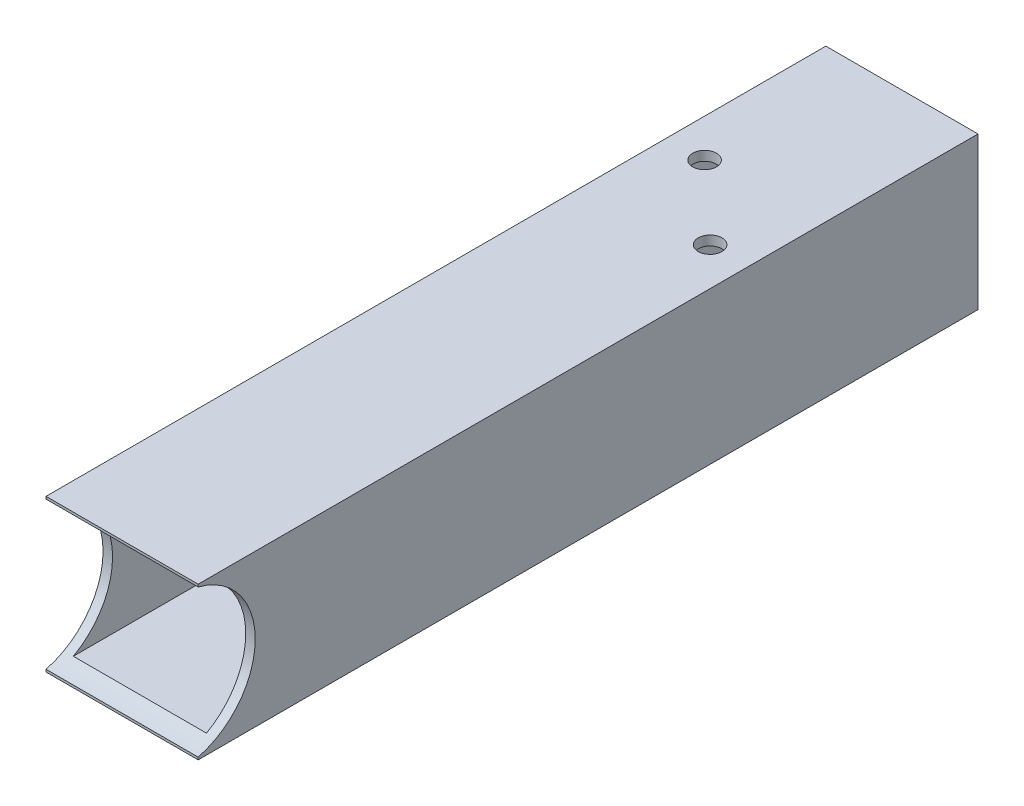
ISO-10303-21;
HEADER;
FILE_DESCRIPTION(('STEP AP214'),'2;1');
FILE_NAME('part.step','',(''),(''),'','','');
FILE_SCHEMA(('AUTOMOTIVE_DESIGN { 1 0 10303 214 1 1 1 1 }'));
ENDSEC;
DATA;
#1=APPLICATION_CONTEXT('core data for automotive mechanical design processes');
#2=APPLICATION_PROTOCOL_DEFINITION('international standard','automotive_design',2000,#1);
#3=PRODUCT_CONTEXT('',#1,'mechanical');
#4=PRODUCT('Part','Part','',(#3));
#5=PRODUCT_RELATED_PRODUCT_CATEGORY('part','',(#4));
#6=PRODUCT_DEFINITION_FORMATION('','',#4);
#7=PRODUCT_DEFINITION_CONTEXT('part definition',#1,'design');
#8=PRODUCT_DEFINITION('design','',#6,#7);
#9=PRODUCT_DEFINITION_SHAPE('','',#8);
#10=(LENGTH_UNIT() NAMED_UNIT(*) SI_UNIT(.MILLI.,.METRE.));
#11=(NAMED_UNIT(*) PLANE_ANGLE_UNIT() SI_UNIT($,.RADIAN.));
#12=(NAMED_UNIT(*) SI_UNIT($,.STERADIAN.) SOLID_ANGLE_UNIT());
#13=UNCERTAINTY_MEASURE_WITH_UNIT(LENGTH_MEASURE(1.E-05),#10,'distance_accuracy_value','');
#14=(GEOMETRIC_REPRESENTATION_CONTEXT(3) GLOBAL_UNCERTAINTY_ASSIGNED_CONTEXT((#13)) GLOBAL_UNIT_ASSIGNED_CONTEXT((#10,
#11,#12)) REPRESENTATION_CONTEXT('',''));
#15=CARTESIAN_POINT('',(0.,0.,0.));
#16=DIRECTION('',(0.,0.,1.));
#17=DIRECTION('',(1.,0.,0.));
#18=AXIS2_PLACEMENT_3D('',#15,#16,#17);
#19=CARTESIAN_POINT('',(0.,0.,260.35));
#20=DIRECTION('',(0.,0.,-1.));
#21=DIRECTION('',(-1.,0.,0.));
#22=AXIS2_PLACEMENT_3D('',#19,#20,#21);
#23=PLANE('',#22);
#24=DIRECTION('',(0.,-1.,0.));
#25=VECTOR('',#24,1.);
#26=CARTESIAN_POINT('',(0.,0.,260.35));
#27=LINE('',#26,#25);
#28=CARTESIAN_POINT('',(0.,50.8,260.35));
#29=VERTEX_POINT('',#28);
#30=CARTESIAN_POINT('',(0.,49.9934442484171,260.35));
#31=VERTEX_POINT('',#30);
#32=EDGE_CURVE('E130',#29,#31,#27,.T.);
#33=ORIENTED_EDGE('',*,*,#32,.T.);
#34=DIRECTION('',(1.,0.,0.));
#35=VECTOR('',#34,1.);
#36=CARTESIAN_POINT('',(0.,49.9934442484171,260.35));
#37=LINE('',#36,#35);
#38=CARTESIAN_POINT('',(50.8,49.9934442484171,260.35));
#39=VERTEX_POINT('',#38);
#40=EDGE_CURVE('E115',#31,#39,#37,.T.);
#41=ORIENTED_EDGE('',*,*,#40,.T.);
#42=DIRECTION('',(0.,1.,0.));
#43=VECTOR('',#42,1.);
#44=CARTESIAN_POINT('',(50.8,0.,260.35));
#45=LINE('',#44,#43);
#46=CARTESIAN_POINT('',(50.8,50.8,260.35));
#47=VERTEX_POINT('',#46);
#48=EDGE_CURVE('E144',#39,#47,#45,.T.);
#49=ORIENTED_EDGE('',*,*,#48,.T.);
#50=DIRECTION('',(-1.,0.,0.));
#51=VECTOR('',#50,1.);
#52=CARTESIAN_POINT('',(0.,50.8,260.35));
#53=LINE('',#52,#51);
#54=EDGE_CURVE('E137',#47,#29,#53,.T.);
#55=ORIENTED_EDGE('',*,*,#54,.T.);
#56=EDGE_LOOP('',(#33,#41,#49,#55));
#57=FACE_BOUND('',#56,.T.);
#58=ADVANCED_FACE('F38',(#57),#23,.F.);
#59=CARTESIAN_POINT('',(50.8,0.,260.35));
#60=VERTEX_POINT('',#59);
#61=CARTESIAN_POINT('',(50.8,0.806555751582911,260.35));
#62=VERTEX_POINT('',#61);
#63=EDGE_CURVE('E151',#60,#62,#45,.T.);
#64=ORIENTED_EDGE('',*,*,#63,.T.);
#65=DIRECTION('',(1.,0.,0.));
#66=VECTOR('',#65,1.);
#67=CARTESIAN_POINT('',(0.,0.806555751582911,260.35));
#68=LINE('',#67,#66);
#69=CARTESIAN_POINT('',(0.,0.806555751582911,260.35));
#70=VERTEX_POINT('',#69);
#71=EDGE_CURVE('E56',#62,#70,#68,.F.);
#72=ORIENTED_EDGE('',*,*,#71,.T.);
#73=CARTESIAN_POINT('',(0.,0.,260.35));
#74=VERTEX_POINT('',#73);
#75=EDGE_CURVE('E132',#70,#74,#27,.T.);
#76=ORIENTED_EDGE('',*,*,#75,.T.);
#77=DIRECTION('',(1.,0.,0.));
#78=VECTOR('',#77,1.);
#79=CARTESIAN_POINT('',(0.,0.,260.35));
#80=LINE('',#79,#78);
#81=EDGE_CURVE('E140',#74,#60,#80,.T.);
#82=ORIENTED_EDGE('',*,*,#81,.T.);
#83=EDGE_LOOP('',(#64,#72,#76,#82));
#84=FACE_BOUND('',#83,.T.);
#85=ADVANCED_FACE('F281',(#84),#23,.F.);
#86=CARTESIAN_POINT('',(0.,0.,0.));
#87=DIRECTION('',(0.,0.,-1.));
#88=DIRECTION('',(-1.,0.,0.));
#89=AXIS2_PLACEMENT_3D('',#86,#87,#88);
#90=PLANE('',#89);
#91=DIRECTION('',(0.,-1.,0.));
#92=VECTOR('',#91,1.);
#93=CARTESIAN_POINT('',(0.,0.,0.));
#94=LINE('',#93,#92);
#95=CARTESIAN_POINT('',(0.,50.8,0.));
#96=VERTEX_POINT('',#95);
#97=CARTESIAN_POINT('',(0.,0.,0.));
#98=VERTEX_POINT('',#97);
#99=EDGE_CURVE('E158',#96,#98,#94,.T.);
#100=ORIENTED_EDGE('',*,*,#99,.F.);
#101=DIRECTION('',(-1.,0.,0.));
#102=VECTOR('',#101,1.);
#103=CARTESIAN_POINT('',(0.,50.8,0.));
#104=LINE('',#103,#102);
#105=CARTESIAN_POINT('',(50.8,50.8,0.));
#106=VERTEX_POINT('',#105);
#107=EDGE_CURVE('E146',#106,#96,#104,.T.);
#108=ORIENTED_EDGE('',*,*,#107,.F.);
#109=DIRECTION('',(0.,1.,0.));
#110=VECTOR('',#109,1.);
#111=CARTESIAN_POINT('',(50.8,0.,0.));
#112=LINE('',#111,#110);
#113=CARTESIAN_POINT('',(50.8,0.,0.));
#114=VERTEX_POINT('',#113);
#115=EDGE_CURVE('E165',#114,#106,#112,.T.);
#116=ORIENTED_EDGE('',*,*,#115,.F.);
#117=DIRECTION('',(1.,0.,0.));
#118=VECTOR('',#117,1.);
#119=CARTESIAN_POINT('',(0.,0.,0.));
#120=LINE('',#119,#118);
#121=EDGE_CURVE('E162',#98,#114,#120,.T.);
#122=ORIENTED_EDGE('',*,*,#121,.F.);
#123=EDGE_LOOP('',(#100,#108,#116,#122));
#124=FACE_BOUND('',#123,.T.);
#125=DIRECTION('',(-1.,0.,0.));
#126=VECTOR('',#125,1.);
#127=CARTESIAN_POINT('',(3.175,47.625,0.));
#128=LINE('',#127,#126);
#129=CARTESIAN_POINT('',(47.625,47.625,0.));
#130=VERTEX_POINT('',#129);
#131=CARTESIAN_POINT('',(3.175,47.625,0.));
#132=VERTEX_POINT('',#131);
#133=EDGE_CURVE('E236',#130,#132,#128,.T.);
#134=ORIENTED_EDGE('',*,*,#133,.T.);
#135=DIRECTION('',(0.,-1.,0.));
#136=VECTOR('',#135,1.);
#137=CARTESIAN_POINT('',(3.175,3.175,0.));
#138=LINE('',#137,#136);
#139=CARTESIAN_POINT('',(3.175,3.175,0.));
#140=VERTEX_POINT('',#139);
#141=EDGE_CURVE('E124',#132,#140,#138,.T.);
#142=ORIENTED_EDGE('',*,*,#141,.T.);
#143=DIRECTION('',(1.,0.,0.));
#144=VECTOR('',#143,1.);
#145=CARTESIAN_POINT('',(3.175,3.175,0.));
#146=LINE('',#145,#144);
#147=CARTESIAN_POINT('',(47.625,3.175,0.));
#148=VERTEX_POINT('',#147);
#149=EDGE_CURVE('E228',#140,#148,#146,.T.);
#150=ORIENTED_EDGE('',*,*,#149,.T.);
#151=DIRECTION('',(0.,1.,0.));
#152=VECTOR('',#151,1.);
#153=CARTESIAN_POINT('',(47.625,3.175,0.));
#154=LINE('',#153,#152);
#155=EDGE_CURVE('E232',#148,#130,#154,.T.);
#156=ORIENTED_EDGE('',*,*,#155,.T.);
#157=EDGE_LOOP('',(#134,#142,#150,#156));
#158=FACE_BOUND('',#157,.T.);
#159=ADVANCED_FACE('F260',(#124,#158),#90,.T.);
#160=CARTESIAN_POINT('',(0.,0.,260.35));
#161=DIRECTION('',(1.,0.,0.));
#162=DIRECTION('',(0.,0.,-1.));
#163=AXIS2_PLACEMENT_3D('',#160,#161,#162);
#164=PLANE('',#163);
#165=ORIENTED_EDGE('',*,*,#75,.F.);
#166=CARTESIAN_POINT('',(0.,25.4,266.7));
#167=DIRECTION('',(1.,0.,0.));
#168=DIRECTION('',(0.,0.,-1.));
#169=AXIS2_PLACEMENT_3D('',#166,#167,#168);
#170=CIRCLE('',#169,25.4);
#171=EDGE_CURVE('E118',#70,#31,#170,.T.);
#172=ORIENTED_EDGE('',*,*,#171,.T.);
#173=ORIENTED_EDGE('',*,*,#32,.F.);
#174=DIRECTION('',(0.,0.,-1.));
#175=VECTOR('',#174,1.);
#176=CARTESIAN_POINT('',(0.,50.8,260.35));
#177=LINE('',#176,#175);
#178=EDGE_CURVE('E157',#29,#96,#177,.T.);
#179=ORIENTED_EDGE('',*,*,#178,.T.);
#180=ORIENTED_EDGE('',*,*,#99,.T.);
#181=DIRECTION('',(0.,0.,-1.));
#182=VECTOR('',#181,1.);
#183=CARTESIAN_POINT('',(0.,0.,260.35));
#184=LINE('',#183,#182);
#185=EDGE_CURVE('E48',#74,#98,#184,.T.);
#186=ORIENTED_EDGE('',*,*,#185,.F.);
#187=EDGE_LOOP('',(#165,#172,#173,#179,#180,#186));
#188=FACE_BOUND('',#187,.T.);
#189=ADVANCED_FACE('F40',(#188),#164,.F.);
#190=CARTESIAN_POINT('',(0.,0.,260.35));
#191=DIRECTION('',(0.,1.,0.));
#192=DIRECTION('',(0.,0.,1.));
#193=AXIS2_PLACEMENT_3D('',#190,#191,#192);
#194=PLANE('',#193);
#195=CARTESIAN_POINT('',(12.7000000000002,0.,53.1750000000008));
#196=DIRECTION('',(0.,-1.,0.));
#197=DIRECTION('',(0.,0.,-1.));
#198=AXIS2_PLACEMENT_3D('',#195,#196,#197);
#199=CIRCLE('',#198,3.96875);
#200=CARTESIAN_POINT('',(12.7000000000002,0.,49.2062500000008));
#201=VERTEX_POINT('',#200);
#202=EDGE_CURVE('E194',#201,#201,#199,.T.);
#203=ORIENTED_EDGE('',*,*,#202,.F.);
#204=EDGE_LOOP('',(#203));
#205=FACE_BOUND('',#204,.T.);
#206=CARTESIAN_POINT('',(38.0999999999999,0.,76.7358336848298));
#207=DIRECTION('',(0.,-1.,0.));
#208=DIRECTION('',(0.,0.,-1.));
#209=AXIS2_PLACEMENT_3D('',#206,#207,#208);
#210=CIRCLE('',#209,3.96875);
#211=CARTESIAN_POINT('',(38.0999999999999,0.,72.7670836848298));
#212=VERTEX_POINT('',#211);
#213=EDGE_CURVE('E206',#212,#212,#210,.T.);
#214=ORIENTED_EDGE('',*,*,#213,.F.);
#215=EDGE_LOOP('',(#214));
#216=FACE_BOUND('',#215,.T.);
#217=ORIENTED_EDGE('',*,*,#121,.T.);
#218=DIRECTION('',(0.,0.,-1.));
#219=VECTOR('',#218,1.);
#220=CARTESIAN_POINT('',(50.8,0.,260.35));
#221=LINE('',#220,#219);
#222=EDGE_CURVE('E176',#60,#114,#221,.T.);
#223=ORIENTED_EDGE('',*,*,#222,.F.);
#224=ORIENTED_EDGE('',*,*,#81,.F.);
#225=ORIENTED_EDGE('',*,*,#185,.T.);
#226=EDGE_LOOP('',(#217,#223,#224,#225));
#227=FACE_BOUND('',#226,.T.);
#228=ADVANCED_FACE('F297',(#205,#216,#227),#194,.F.);
#229=CARTESIAN_POINT('',(50.8,0.,260.35));
#230=DIRECTION('',(-1.,0.,0.));
#231=DIRECTION('',(0.,0.,1.));
#232=AXIS2_PLACEMENT_3D('',#229,#230,#231);
#233=PLANE('',#232);
#234=ORIENTED_EDGE('',*,*,#48,.F.);
#235=CARTESIAN_POINT('',(50.8,25.4,266.7));
#236=DIRECTION('',(1.,0.,0.));
#237=DIRECTION('',(0.,0.,-1.));
#238=AXIS2_PLACEMENT_3D('',#235,#236,#237);
#239=CIRCLE('',#238,25.4);
#240=EDGE_CURVE('E119',#62,#39,#239,.T.);
#241=ORIENTED_EDGE('',*,*,#240,.F.);
#242=ORIENTED_EDGE('',*,*,#63,.F.);
#243=ORIENTED_EDGE('',*,*,#222,.T.);
#244=ORIENTED_EDGE('',*,*,#115,.T.);
#245=DIRECTION('',(0.,0.,-1.));
#246=VECTOR('',#245,1.);
#247=CARTESIAN_POINT('',(50.8,50.8,260.35));
#248=LINE('',#247,#246);
#249=EDGE_CURVE('E172',#47,#106,#248,.T.);
#250=ORIENTED_EDGE('',*,*,#249,.F.);
#251=EDGE_LOOP('',(#234,#241,#242,#243,#244,#250));
#252=FACE_BOUND('',#251,.T.);
#253=ADVANCED_FACE('F295',(#252),#233,.F.);
#254=CARTESIAN_POINT('',(0.,50.8,260.35));
#255=DIRECTION('',(0.,-1.,0.));
#256=DIRECTION('',(0.,0.,-1.));
#257=AXIS2_PLACEMENT_3D('',#254,#255,#256);
#258=PLANE('',#257);
#259=CARTESIAN_POINT('',(12.7000000000002,50.8,53.1750000000008));
#260=DIRECTION('',(0.,-1.,0.));
#261=DIRECTION('',(0.,0.,-1.));
#262=AXIS2_PLACEMENT_3D('',#259,#260,#261);
#263=CIRCLE('',#262,3.96875);
#264=CARTESIAN_POINT('',(12.7000000000002,50.8,49.2062500000008));
#265=VERTEX_POINT('',#264);
#266=EDGE_CURVE('E186',#265,#265,#263,.T.);
#267=ORIENTED_EDGE('',*,*,#266,.T.);
#268=EDGE_LOOP('',(#267));
#269=FACE_BOUND('',#268,.T.);
#270=CARTESIAN_POINT('',(38.0999999999999,50.8,76.7358336848298));
#271=DIRECTION('',(0.,-1.,0.));
#272=DIRECTION('',(0.,0.,-1.));
#273=AXIS2_PLACEMENT_3D('',#270,#271,#272);
#274=CIRCLE('',#273,3.96875);
#275=CARTESIAN_POINT('',(38.0999999999999,50.8,72.7670836848298));
#276=VERTEX_POINT('',#275);
#277=EDGE_CURVE('E200',#276,#276,#274,.T.);
#278=ORIENTED_EDGE('',*,*,#277,.T.);
#279=EDGE_LOOP('',(#278));
#280=FACE_BOUND('',#279,.T.);
#281=ORIENTED_EDGE('',*,*,#107,.T.);
#282=ORIENTED_EDGE('',*,*,#178,.F.);
#283=ORIENTED_EDGE('',*,*,#54,.F.);
#284=ORIENTED_EDGE('',*,*,#249,.T.);
#285=EDGE_LOOP('',(#281,#282,#283,#284));
#286=FACE_BOUND('',#285,.T.);
#287=ADVANCED_FACE('F292',(#269,#280,#286),#258,.F.);
#288=CARTESIAN_POINT('',(3.175,3.175,260.35));
#289=DIRECTION('',(1.,0.,0.));
#290=DIRECTION('',(0.,0.,-1.));
#291=AXIS2_PLACEMENT_3D('',#288,#289,#290);
#292=PLANE('',#291);
#293=CARTESIAN_POINT('',(3.175,25.4,266.7));
#294=DIRECTION('',(1.,0.,0.));
#295=DIRECTION('',(0.,0.,-1.));
#296=AXIS2_PLACEMENT_3D('',#293,#294,#295);
#297=CIRCLE('',#296,25.4);
#298=CARTESIAN_POINT('',(3.175,3.175,254.403277875791));
#299=VERTEX_POINT('',#298);
#300=CARTESIAN_POINT('',(3.175,47.625,254.403277875791));
#301=VERTEX_POINT('',#300);
#302=EDGE_CURVE('E63',#299,#301,#297,.T.);
#303=ORIENTED_EDGE('',*,*,#302,.F.);
#304=DIRECTION('',(0.,0.,-1.));
#305=VECTOR('',#304,1.);
#306=CARTESIAN_POINT('',(3.175,3.175,260.35));
#307=LINE('',#306,#305);
#308=EDGE_CURVE('E148',#299,#140,#307,.T.);
#309=ORIENTED_EDGE('',*,*,#308,.T.);
#310=ORIENTED_EDGE('',*,*,#141,.F.);
#311=DIRECTION('',(0.,0.,-1.));
#312=VECTOR('',#311,1.);
#313=CARTESIAN_POINT('',(3.175,47.625,260.35));
#314=LINE('',#313,#312);
#315=EDGE_CURVE('E240',#301,#132,#314,.T.);
#316=ORIENTED_EDGE('',*,*,#315,.F.);
#317=EDGE_LOOP('',(#303,#309,#310,#316));
#318=FACE_BOUND('',#317,.T.);
#319=ADVANCED_FACE('F256',(#318),#292,.T.);
#320=CARTESIAN_POINT('',(3.175,3.175,260.35));
#321=DIRECTION('',(0.,1.,0.));
#322=DIRECTION('',(0.,0.,1.));
#323=AXIS2_PLACEMENT_3D('',#320,#321,#322);
#324=PLANE('',#323);
#325=CARTESIAN_POINT('',(12.7000000000002,3.175,53.1750000000008));
#326=DIRECTION('',(0.,1.,0.));
#327=DIRECTION('',(0.,0.,1.));
#328=AXIS2_PLACEMENT_3D('',#325,#326,#327);
#329=CIRCLE('',#328,3.96875);
#330=CARTESIAN_POINT('',(12.7000000000002,3.175,57.1437500000008));
#331=VERTEX_POINT('',#330);
#332=EDGE_CURVE('E210',#331,#331,#329,.T.);
#333=ORIENTED_EDGE('',*,*,#332,.F.);
#334=EDGE_LOOP('',(#333));
#335=FACE_BOUND('',#334,.T.);
#336=CARTESIAN_POINT('',(38.0999999999999,3.175,76.7358336848298));
#337=DIRECTION('',(0.,1.,0.));
#338=DIRECTION('',(0.,0.,1.));
#339=AXIS2_PLACEMENT_3D('',#336,#337,#338);
#340=CIRCLE('',#339,3.96875);
#341=CARTESIAN_POINT('',(38.0999999999999,3.175,80.7045836848298));
#342=VERTEX_POINT('',#341);
#343=EDGE_CURVE('E185',#342,#342,#340,.T.);
#344=ORIENTED_EDGE('',*,*,#343,.F.);
#345=EDGE_LOOP('',(#344));
#346=FACE_BOUND('',#345,.T.);
#347=DIRECTION('',(1.,0.,0.));
#348=VECTOR('',#347,1.);
#349=CARTESIAN_POINT('',(0.,3.175,254.403277875791));
#350=LINE('',#349,#348);
#351=CARTESIAN_POINT('',(47.625,3.175,254.403277875791));
#352=VERTEX_POINT('',#351);
#353=EDGE_CURVE('E218',#352,#299,#350,.F.);
#354=ORIENTED_EDGE('',*,*,#353,.F.);
#355=DIRECTION('',(0.,0.,-1.));
#356=VECTOR('',#355,1.);
#357=CARTESIAN_POINT('',(47.625,3.175,260.35));
#358=LINE('',#357,#356);
#359=EDGE_CURVE('E245',#352,#148,#358,.T.);
#360=ORIENTED_EDGE('',*,*,#359,.T.);
#361=ORIENTED_EDGE('',*,*,#149,.F.);
#362=ORIENTED_EDGE('',*,*,#308,.F.);
#363=EDGE_LOOP('',(#354,#360,#361,#362));
#364=FACE_BOUND('',#363,.T.);
#365=ADVANCED_FACE('F258',(#335,#346,#364),#324,.T.);
#366=CARTESIAN_POINT('',(47.625,3.175,260.35));
#367=DIRECTION('',(-1.,0.,0.));
#368=DIRECTION('',(0.,0.,1.));
#369=AXIS2_PLACEMENT_3D('',#366,#367,#368);
#370=PLANE('',#369);
#371=CARTESIAN_POINT('',(47.625,25.4,266.7));
#372=DIRECTION('',(-1.,0.,0.));
#373=DIRECTION('',(0.,0.,1.));
#374=AXIS2_PLACEMENT_3D('',#371,#372,#373);
#375=CIRCLE('',#374,25.4);
#376=CARTESIAN_POINT('',(47.625,47.625,254.403277875791));
#377=VERTEX_POINT('',#376);
#378=EDGE_CURVE('E134',#377,#352,#375,.T.);
#379=ORIENTED_EDGE('',*,*,#378,.F.);
#380=DIRECTION('',(0.,0.,-1.));
#381=VECTOR('',#380,1.);
#382=CARTESIAN_POINT('',(47.625,47.625,260.35));
#383=LINE('',#382,#381);
#384=EDGE_CURVE('E243',#377,#130,#383,.T.);
#385=ORIENTED_EDGE('',*,*,#384,.T.);
#386=ORIENTED_EDGE('',*,*,#155,.F.);
#387=ORIENTED_EDGE('',*,*,#359,.F.);
#388=EDGE_LOOP('',(#379,#385,#386,#387));
#389=FACE_BOUND('',#388,.T.);
#390=ADVANCED_FACE('F267',(#389),#370,.T.);
#391=CARTESIAN_POINT('',(3.175,47.625,260.35));
#392=DIRECTION('',(0.,-1.,0.));
#393=DIRECTION('',(0.,0.,-1.));
#394=AXIS2_PLACEMENT_3D('',#391,#392,#393);
#395=PLANE('',#394);
#396=CARTESIAN_POINT('',(12.7000000000002,47.625,53.1750000000008));
#397=DIRECTION('',(0.,-1.,0.));
#398=DIRECTION('',(0.,0.,-1.));
#399=AXIS2_PLACEMENT_3D('',#396,#397,#398);
#400=CIRCLE('',#399,3.96875);
#401=CARTESIAN_POINT('',(12.7000000000002,47.625,49.2062500000008));
#402=VERTEX_POINT('',#401);
#403=EDGE_CURVE('E42',#402,#402,#400,.T.);
#404=ORIENTED_EDGE('',*,*,#403,.F.);
#405=EDGE_LOOP('',(#404));
#406=FACE_BOUND('',#405,.T.);
#407=CARTESIAN_POINT('',(38.0999999999999,47.625,76.7358336848298));
#408=DIRECTION('',(0.,-1.,0.));
#409=DIRECTION('',(0.,0.,-1.));
#410=AXIS2_PLACEMENT_3D('',#407,#408,#409);
#411=CIRCLE('',#410,3.96875);
#412=CARTESIAN_POINT('',(38.0999999999999,47.625,72.7670836848298));
#413=VERTEX_POINT('',#412);
#414=EDGE_CURVE('E182',#413,#413,#411,.T.);
#415=ORIENTED_EDGE('',*,*,#414,.F.);
#416=EDGE_LOOP('',(#415));
#417=FACE_BOUND('',#416,.T.);
#418=DIRECTION('',(1.,0.,0.));
#419=VECTOR('',#418,1.);
#420=CARTESIAN_POINT('',(0.,47.625,254.403277875791));
#421=LINE('',#420,#419);
#422=EDGE_CURVE('E11',#301,#377,#421,.T.);
#423=ORIENTED_EDGE('',*,*,#422,.F.);
#424=ORIENTED_EDGE('',*,*,#315,.T.);
#425=ORIENTED_EDGE('',*,*,#133,.F.);
#426=ORIENTED_EDGE('',*,*,#384,.F.);
#427=EDGE_LOOP('',(#423,#424,#425,#426));
#428=FACE_BOUND('',#427,.T.);
#429=ADVANCED_FACE('F264',(#406,#417,#428),#395,.T.);
#430=CARTESIAN_POINT('',(0.,25.4,266.7));
#431=DIRECTION('',(1.,0.,0.));
#432=DIRECTION('',(0.,0.,-1.));
#433=AXIS2_PLACEMENT_3D('',#430,#431,#432);
#434=CYLINDRICAL_SURFACE('',#433,25.4);
#435=ORIENTED_EDGE('',*,*,#302,.T.);
#436=ORIENTED_EDGE('',*,*,#422,.T.);
#437=ORIENTED_EDGE('',*,*,#378,.T.);
#438=ORIENTED_EDGE('',*,*,#353,.T.);
#439=EDGE_LOOP('',(#435,#436,#437,#438));
#440=FACE_BOUND('',#439,.T.);
#441=ORIENTED_EDGE('',*,*,#171,.F.);
#442=ORIENTED_EDGE('',*,*,#71,.F.);
#443=ORIENTED_EDGE('',*,*,#240,.T.);
#444=ORIENTED_EDGE('',*,*,#40,.F.);
#445=EDGE_LOOP('',(#441,#442,#443,#444));
#446=FACE_BOUND('',#445,.T.);
#447=ADVANCED_FACE('F117',(#440,#446),#434,.F.);
#448=CARTESIAN_POINT('',(38.0999999999999,50.8,76.7358336848298));
#449=DIRECTION('',(0.,-1.,0.));
#450=DIRECTION('',(0.,0.,-1.));
#451=AXIS2_PLACEMENT_3D('',#448,#449,#450);
#452=CYLINDRICAL_SURFACE('',#451,3.96875);
#453=ORIENTED_EDGE('',*,*,#414,.T.);
#454=EDGE_LOOP('',(#453));
#455=FACE_BOUND('',#454,.T.);
#456=ORIENTED_EDGE('',*,*,#277,.F.);
#457=EDGE_LOOP('',(#456));
#458=FACE_BOUND('',#457,.T.);
#459=ADVANCED_FACE('F325',(#455,#458),#452,.F.);
#460=CARTESIAN_POINT('',(12.7000000000002,50.8,53.1750000000008));
#461=DIRECTION('',(0.,-1.,0.));
#462=DIRECTION('',(0.,0.,-1.));
#463=AXIS2_PLACEMENT_3D('',#460,#461,#462);
#464=CYLINDRICAL_SURFACE('',#463,3.96875);
#465=ORIENTED_EDGE('',*,*,#403,.T.);
#466=EDGE_LOOP('',(#465));
#467=FACE_BOUND('',#466,.T.);
#468=ORIENTED_EDGE('',*,*,#266,.F.);
#469=EDGE_LOOP('',(#468));
#470=FACE_BOUND('',#469,.T.);
#471=ADVANCED_FACE('F322',(#467,#470),#464,.F.);
#472=ORIENTED_EDGE('',*,*,#343,.T.);
#473=EDGE_LOOP('',(#472));
#474=FACE_BOUND('',#473,.T.);
#475=ORIENTED_EDGE('',*,*,#213,.T.);
#476=EDGE_LOOP('',(#475));
#477=FACE_BOUND('',#476,.T.);
#478=ADVANCED_FACE('F319',(#474,#477),#452,.F.);
#479=ORIENTED_EDGE('',*,*,#332,.T.);
#480=EDGE_LOOP('',(#479));
#481=FACE_BOUND('',#480,.T.);
#482=ORIENTED_EDGE('',*,*,#202,.T.);
#483=EDGE_LOOP('',(#482));
#484=FACE_BOUND('',#483,.T.);
#485=ADVANCED_FACE('F321',(#481,#484),#464,.F.);
#486=CLOSED_SHELL('',(#58,#85,#159,#189,#228,#253,#287,#319,#365,#390,#429,#447,#459,#471,#478,#485));
#487=MANIFOLD_SOLID_BREP('B2',#486);
#488=ADVANCED_BREP_SHAPE_REPRESENTATION('',(#18,#487),#14);
#489=SHAPE_DEFINITION_REPRESENTATION(#9,#488);
ENDSEC;
END-ISO-10303-21;
